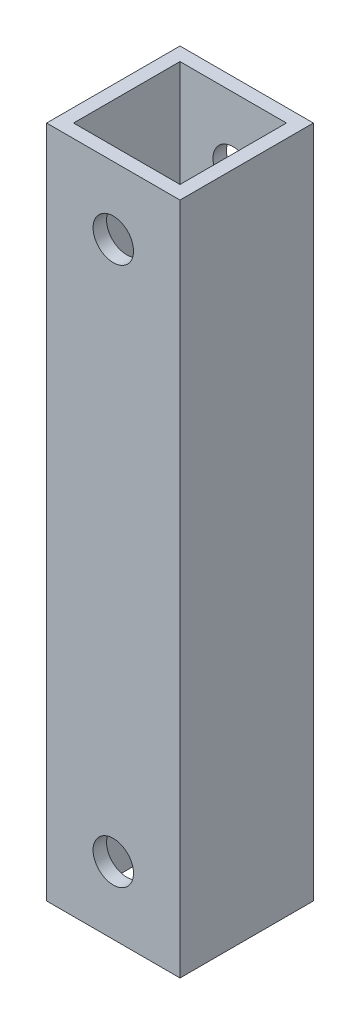
ISO-10303-21;
HEADER;
FILE_DESCRIPTION(('STEP AP214'),'2;1');
FILE_NAME('part.step','',(''),(''),'','','');
FILE_SCHEMA(('AUTOMOTIVE_DESIGN { 1 0 10303 214 1 1 1 1 }'));
ENDSEC;
DATA;
#1=APPLICATION_CONTEXT('core data for automotive mechanical design processes');
#2=APPLICATION_PROTOCOL_DEFINITION('international standard','automotive_design',2000,#1);
#3=PRODUCT_CONTEXT('',#1,'mechanical');
#4=PRODUCT('Part','Part','',(#3));
#5=PRODUCT_RELATED_PRODUCT_CATEGORY('part','',(#4));
#6=PRODUCT_DEFINITION_FORMATION('','',#4);
#7=PRODUCT_DEFINITION_CONTEXT('part definition',#1,'design');
#8=PRODUCT_DEFINITION('design','',#6,#7);
#9=PRODUCT_DEFINITION_SHAPE('','',#8);
#10=(LENGTH_UNIT() NAMED_UNIT(*) SI_UNIT(.MILLI.,.METRE.));
#11=(NAMED_UNIT(*) PLANE_ANGLE_UNIT() SI_UNIT($,.RADIAN.));
#12=(NAMED_UNIT(*) SI_UNIT($,.STERADIAN.) SOLID_ANGLE_UNIT());
#13=UNCERTAINTY_MEASURE_WITH_UNIT(LENGTH_MEASURE(1.E-05),#10,'distance_accuracy_value','');
#14=(GEOMETRIC_REPRESENTATION_CONTEXT(3) GLOBAL_UNCERTAINTY_ASSIGNED_CONTEXT((#13)) GLOBAL_UNIT_ASSIGNED_CONTEXT((#10,
#11,#12)) REPRESENTATION_CONTEXT('',''));
#15=CARTESIAN_POINT('',(0.,0.,0.));
#16=DIRECTION('',(0.,0.,1.));
#17=DIRECTION('',(1.,0.,0.));
#18=AXIS2_PLACEMENT_3D('',#15,#16,#17);
#19=CARTESIAN_POINT('',(0.,50.,0.));
#20=DIRECTION('',(0.,1.,0.));
#21=DIRECTION('',(0.,0.,1.));
#22=AXIS2_PLACEMENT_3D('',#19,#20,#21);
#23=PLANE('',#22);
#24=DIRECTION('',(0.,0.,1.));
#25=VECTOR('',#24,1.);
#26=CARTESIAN_POINT('',(-4.95,50.,4.95));
#27=LINE('',#26,#25);
#28=CARTESIAN_POINT('',(-4.95,50.,-4.95));
#29=VERTEX_POINT('',#28);
#30=CARTESIAN_POINT('',(-4.95,50.,4.95));
#31=VERTEX_POINT('',#30);
#32=EDGE_CURVE('E140',#29,#31,#27,.T.);
#33=ORIENTED_EDGE('',*,*,#32,.T.);
#34=DIRECTION('',(1.,0.,0.));
#35=VECTOR('',#34,1.);
#36=CARTESIAN_POINT('',(4.95,50.,4.95));
#37=LINE('',#36,#35);
#38=CARTESIAN_POINT('',(4.95,50.,4.95));
#39=VERTEX_POINT('',#38);
#40=EDGE_CURVE('E143',#31,#39,#37,.T.);
#41=ORIENTED_EDGE('',*,*,#40,.T.);
#42=DIRECTION('',(0.,0.,-1.));
#43=VECTOR('',#42,1.);
#44=CARTESIAN_POINT('',(4.95,50.,4.95));
#45=LINE('',#44,#43);
#46=CARTESIAN_POINT('',(4.95,50.,-4.95));
#47=VERTEX_POINT('',#46);
#48=EDGE_CURVE('E146',#39,#47,#45,.T.);
#49=ORIENTED_EDGE('',*,*,#48,.T.);
#50=DIRECTION('',(-1.,0.,0.));
#51=VECTOR('',#50,1.);
#52=CARTESIAN_POINT('',(4.95,50.,-4.95));
#53=LINE('',#52,#51);
#54=EDGE_CURVE('E148',#47,#29,#53,.T.);
#55=ORIENTED_EDGE('',*,*,#54,.T.);
#56=EDGE_LOOP('',(#33,#41,#49,#55));
#57=FACE_BOUND('',#56,.T.);
#58=DIRECTION('',(1.,0.,0.));
#59=VECTOR('',#58,1.);
#60=CARTESIAN_POINT('',(3.95,50.,3.95));
#61=LINE('',#60,#59);
#62=CARTESIAN_POINT('',(-3.95,50.,3.95));
#63=VERTEX_POINT('',#62);
#64=CARTESIAN_POINT('',(3.95,50.,3.95));
#65=VERTEX_POINT('',#64);
#66=EDGE_CURVE('E110',#63,#65,#61,.T.);
#67=ORIENTED_EDGE('',*,*,#66,.F.);
#68=DIRECTION('',(0.,0.,1.));
#69=VECTOR('',#68,1.);
#70=CARTESIAN_POINT('',(-3.95,50.,-3.95));
#71=LINE('',#70,#69);
#72=CARTESIAN_POINT('',(-3.95,50.,-3.95));
#73=VERTEX_POINT('',#72);
#74=EDGE_CURVE('E102',#73,#63,#71,.T.);
#75=ORIENTED_EDGE('',*,*,#74,.F.);
#76=DIRECTION('',(-1.,0.,0.));
#77=VECTOR('',#76,1.);
#78=CARTESIAN_POINT('',(3.95,50.,-3.95));
#79=LINE('',#78,#77);
#80=CARTESIAN_POINT('',(3.95,50.,-3.95));
#81=VERTEX_POINT('',#80);
#82=EDGE_CURVE('E124',#81,#73,#79,.T.);
#83=ORIENTED_EDGE('',*,*,#82,.F.);
#84=DIRECTION('',(0.,0.,-1.));
#85=VECTOR('',#84,1.);
#86=CARTESIAN_POINT('',(3.95,50.,-3.95));
#87=LINE('',#86,#85);
#88=EDGE_CURVE('E122',#65,#81,#87,.T.);
#89=ORIENTED_EDGE('',*,*,#88,.F.);
#90=EDGE_LOOP('',(#67,#75,#83,#89));
#91=FACE_BOUND('',#90,.T.);
#92=ADVANCED_FACE('F35',(#57,#91),#23,.T.);
#93=CARTESIAN_POINT('',(0.,0.,0.));
#94=DIRECTION('',(0.,1.,0.));
#95=DIRECTION('',(0.,0.,1.));
#96=AXIS2_PLACEMENT_3D('',#93,#94,#95);
#97=PLANE('',#96);
#98=DIRECTION('',(0.,0.,1.));
#99=VECTOR('',#98,1.);
#100=CARTESIAN_POINT('',(-4.95,0.,4.95));
#101=LINE('',#100,#99);
#102=CARTESIAN_POINT('',(-4.95,0.,-4.95));
#103=VERTEX_POINT('',#102);
#104=CARTESIAN_POINT('',(-4.95,0.,4.95));
#105=VERTEX_POINT('',#104);
#106=EDGE_CURVE('E118',#103,#105,#101,.T.);
#107=ORIENTED_EDGE('',*,*,#106,.F.);
#108=DIRECTION('',(-1.,0.,0.));
#109=VECTOR('',#108,1.);
#110=CARTESIAN_POINT('',(4.95,0.,-4.95));
#111=LINE('',#110,#109);
#112=CARTESIAN_POINT('',(4.95,0.,-4.95));
#113=VERTEX_POINT('',#112);
#114=EDGE_CURVE('E144',#113,#103,#111,.T.);
#115=ORIENTED_EDGE('',*,*,#114,.F.);
#116=DIRECTION('',(0.,0.,-1.));
#117=VECTOR('',#116,1.);
#118=CARTESIAN_POINT('',(4.95,0.,4.95));
#119=LINE('',#118,#117);
#120=CARTESIAN_POINT('',(4.95,0.,4.95));
#121=VERTEX_POINT('',#120);
#122=EDGE_CURVE('E155',#121,#113,#119,.T.);
#123=ORIENTED_EDGE('',*,*,#122,.F.);
#124=DIRECTION('',(1.,0.,0.));
#125=VECTOR('',#124,1.);
#126=CARTESIAN_POINT('',(4.95,0.,4.95));
#127=LINE('',#126,#125);
#128=EDGE_CURVE('E153',#105,#121,#127,.T.);
#129=ORIENTED_EDGE('',*,*,#128,.F.);
#130=EDGE_LOOP('',(#107,#115,#123,#129));
#131=FACE_BOUND('',#130,.T.);
#132=DIRECTION('',(0.,0.,1.));
#133=VECTOR('',#132,1.);
#134=CARTESIAN_POINT('',(-3.95,0.,-3.95));
#135=LINE('',#134,#133);
#136=CARTESIAN_POINT('',(-3.95,0.,-3.95));
#137=VERTEX_POINT('',#136);
#138=CARTESIAN_POINT('',(-3.95,0.,3.95));
#139=VERTEX_POINT('',#138);
#140=EDGE_CURVE('E60',#137,#139,#135,.T.);
#141=ORIENTED_EDGE('',*,*,#140,.T.);
#142=DIRECTION('',(1.,0.,0.));
#143=VECTOR('',#142,1.);
#144=CARTESIAN_POINT('',(3.95,0.,3.95));
#145=LINE('',#144,#143);
#146=CARTESIAN_POINT('',(3.95,0.,3.95));
#147=VERTEX_POINT('',#146);
#148=EDGE_CURVE('E117',#139,#147,#145,.T.);
#149=ORIENTED_EDGE('',*,*,#148,.T.);
#150=DIRECTION('',(0.,0.,-1.));
#151=VECTOR('',#150,1.);
#152=CARTESIAN_POINT('',(3.95,0.,-3.95));
#153=LINE('',#152,#151);
#154=CARTESIAN_POINT('',(3.95,0.,-3.95));
#155=VERTEX_POINT('',#154);
#156=EDGE_CURVE('E132',#147,#155,#153,.T.);
#157=ORIENTED_EDGE('',*,*,#156,.T.);
#158=DIRECTION('',(-1.,0.,0.));
#159=VECTOR('',#158,1.);
#160=CARTESIAN_POINT('',(3.95,0.,-3.95));
#161=LINE('',#160,#159);
#162=EDGE_CURVE('E111',#155,#137,#161,.T.);
#163=ORIENTED_EDGE('',*,*,#162,.T.);
#164=EDGE_LOOP('',(#141,#149,#157,#163));
#165=FACE_BOUND('',#164,.T.);
#166=ADVANCED_FACE('F202',(#131,#165),#97,.F.);
#167=CARTESIAN_POINT('',(-4.95,50.,4.95));
#168=DIRECTION('',(1.,0.,0.));
#169=DIRECTION('',(0.,0.,-1.));
#170=AXIS2_PLACEMENT_3D('',#167,#168,#169);
#171=PLANE('',#170);
#172=ORIENTED_EDGE('',*,*,#106,.T.);
#173=DIRECTION('',(0.,-1.,0.));
#174=VECTOR('',#173,1.);
#175=CARTESIAN_POINT('',(-4.95,50.,4.95));
#176=LINE('',#175,#174);
#177=EDGE_CURVE('E11',#31,#105,#176,.T.);
#178=ORIENTED_EDGE('',*,*,#177,.F.);
#179=ORIENTED_EDGE('',*,*,#32,.F.);
#180=DIRECTION('',(0.,-1.,0.));
#181=VECTOR('',#180,1.);
#182=CARTESIAN_POINT('',(-4.95,50.,-4.95));
#183=LINE('',#182,#181);
#184=EDGE_CURVE('E150',#29,#103,#183,.T.);
#185=ORIENTED_EDGE('',*,*,#184,.T.);
#186=EDGE_LOOP('',(#172,#178,#179,#185));
#187=FACE_BOUND('',#186,.T.);
#188=ADVANCED_FACE('F37',(#187),#171,.F.);
#189=CARTESIAN_POINT('',(4.95,50.,4.95));
#190=DIRECTION('',(0.,0.,-1.));
#191=DIRECTION('',(-1.,0.,0.));
#192=AXIS2_PLACEMENT_3D('',#189,#190,#191);
#193=PLANE('',#192);
#194=CARTESIAN_POINT('',(0.,5.,4.95));
#195=DIRECTION('',(0.,0.,-1.));
#196=DIRECTION('',(-1.,0.,0.));
#197=AXIS2_PLACEMENT_3D('',#194,#195,#196);
#198=CIRCLE('',#197,1.5);
#199=CARTESIAN_POINT('',(-1.50000000000001,5.,4.95));
#200=VERTEX_POINT('',#199);
#201=EDGE_CURVE('E184',#200,#200,#198,.T.);
#202=ORIENTED_EDGE('',*,*,#201,.T.);
#203=EDGE_LOOP('',(#202));
#204=FACE_BOUND('',#203,.T.);
#205=CARTESIAN_POINT('',(0.,45.,4.95));
#206=DIRECTION('',(0.,0.,-1.));
#207=DIRECTION('',(-1.,0.,0.));
#208=AXIS2_PLACEMENT_3D('',#205,#206,#207);
#209=CIRCLE('',#208,1.5);
#210=CARTESIAN_POINT('',(-1.5,45.,4.95));
#211=VERTEX_POINT('',#210);
#212=EDGE_CURVE('E166',#211,#211,#209,.T.);
#213=ORIENTED_EDGE('',*,*,#212,.T.);
#214=EDGE_LOOP('',(#213));
#215=FACE_BOUND('',#214,.T.);
#216=ORIENTED_EDGE('',*,*,#128,.T.);
#217=DIRECTION('',(0.,-1.,0.));
#218=VECTOR('',#217,1.);
#219=CARTESIAN_POINT('',(4.95,50.,4.95));
#220=LINE('',#219,#218);
#221=EDGE_CURVE('E44',#39,#121,#220,.T.);
#222=ORIENTED_EDGE('',*,*,#221,.F.);
#223=ORIENTED_EDGE('',*,*,#40,.F.);
#224=ORIENTED_EDGE('',*,*,#177,.T.);
#225=EDGE_LOOP('',(#216,#222,#223,#224));
#226=FACE_BOUND('',#225,.T.);
#227=ADVANCED_FACE('F227',(#204,#215,#226),#193,.F.);
#228=CARTESIAN_POINT('',(4.95,50.,4.95));
#229=DIRECTION('',(-1.,0.,0.));
#230=DIRECTION('',(0.,0.,1.));
#231=AXIS2_PLACEMENT_3D('',#228,#229,#230);
#232=PLANE('',#231);
#233=ORIENTED_EDGE('',*,*,#122,.T.);
#234=DIRECTION('',(0.,-1.,0.));
#235=VECTOR('',#234,1.);
#236=CARTESIAN_POINT('',(4.95,50.,-4.95));
#237=LINE('',#236,#235);
#238=EDGE_CURVE('E160',#47,#113,#237,.T.);
#239=ORIENTED_EDGE('',*,*,#238,.F.);
#240=ORIENTED_EDGE('',*,*,#48,.F.);
#241=ORIENTED_EDGE('',*,*,#221,.T.);
#242=EDGE_LOOP('',(#233,#239,#240,#241));
#243=FACE_BOUND('',#242,.T.);
#244=ADVANCED_FACE('F224',(#243),#232,.F.);
#245=CARTESIAN_POINT('',(4.95,50.,-4.95));
#246=DIRECTION('',(0.,0.,1.));
#247=DIRECTION('',(1.,0.,0.));
#248=AXIS2_PLACEMENT_3D('',#245,#246,#247);
#249=PLANE('',#248);
#250=CARTESIAN_POINT('',(0.,5.,-4.95));
#251=DIRECTION('',(0.,0.,-1.));
#252=DIRECTION('',(-1.,0.,0.));
#253=AXIS2_PLACEMENT_3D('',#250,#251,#252);
#254=CIRCLE('',#253,1.5);
#255=CARTESIAN_POINT('',(-1.50000000000001,5.,-4.95));
#256=VERTEX_POINT('',#255);
#257=EDGE_CURVE('E181',#256,#256,#254,.T.);
#258=ORIENTED_EDGE('',*,*,#257,.F.);
#259=EDGE_LOOP('',(#258));
#260=FACE_BOUND('',#259,.T.);
#261=CARTESIAN_POINT('',(0.,45.,-4.95));
#262=DIRECTION('',(0.,0.,-1.));
#263=DIRECTION('',(-1.,0.,0.));
#264=AXIS2_PLACEMENT_3D('',#261,#262,#263);
#265=CIRCLE('',#264,1.5);
#266=CARTESIAN_POINT('',(-1.5,45.,-4.95));
#267=VERTEX_POINT('',#266);
#268=EDGE_CURVE('E171',#267,#267,#265,.T.);
#269=ORIENTED_EDGE('',*,*,#268,.F.);
#270=EDGE_LOOP('',(#269));
#271=FACE_BOUND('',#270,.T.);
#272=ORIENTED_EDGE('',*,*,#114,.T.);
#273=ORIENTED_EDGE('',*,*,#184,.F.);
#274=ORIENTED_EDGE('',*,*,#54,.F.);
#275=ORIENTED_EDGE('',*,*,#238,.T.);
#276=EDGE_LOOP('',(#272,#273,#274,#275));
#277=FACE_BOUND('',#276,.T.);
#278=ADVANCED_FACE('F221',(#260,#271,#277),#249,.F.);
#279=CARTESIAN_POINT('',(-3.95,50.,-3.95));
#280=DIRECTION('',(1.,0.,0.));
#281=DIRECTION('',(0.,0.,-1.));
#282=AXIS2_PLACEMENT_3D('',#279,#280,#281);
#283=PLANE('',#282);
#284=ORIENTED_EDGE('',*,*,#140,.F.);
#285=DIRECTION('',(0.,-1.,0.));
#286=VECTOR('',#285,1.);
#287=CARTESIAN_POINT('',(-3.95,50.,-3.95));
#288=LINE('',#287,#286);
#289=EDGE_CURVE('E106',#73,#137,#288,.T.);
#290=ORIENTED_EDGE('',*,*,#289,.F.);
#291=ORIENTED_EDGE('',*,*,#74,.T.);
#292=DIRECTION('',(0.,-1.,0.));
#293=VECTOR('',#292,1.);
#294=CARTESIAN_POINT('',(-3.95,50.,3.95));
#295=LINE('',#294,#293);
#296=EDGE_CURVE('E105',#63,#139,#295,.T.);
#297=ORIENTED_EDGE('',*,*,#296,.T.);
#298=EDGE_LOOP('',(#284,#290,#291,#297));
#299=FACE_BOUND('',#298,.T.);
#300=ADVANCED_FACE('F104',(#299),#283,.T.);
#301=CARTESIAN_POINT('',(3.95,50.,3.95));
#302=DIRECTION('',(0.,0.,-1.));
#303=DIRECTION('',(-1.,0.,0.));
#304=AXIS2_PLACEMENT_3D('',#301,#302,#303);
#305=PLANE('',#304);
#306=CARTESIAN_POINT('',(0.,5.,3.95));
#307=DIRECTION('',(0.,0.,-1.));
#308=DIRECTION('',(-1.,0.,0.));
#309=AXIS2_PLACEMENT_3D('',#306,#307,#308);
#310=CIRCLE('',#309,1.5);
#311=CARTESIAN_POINT('',(-1.50000000000001,5.,3.95));
#312=VERTEX_POINT('',#311);
#313=EDGE_CURVE('E176',#312,#312,#310,.T.);
#314=ORIENTED_EDGE('',*,*,#313,.F.);
#315=EDGE_LOOP('',(#314));
#316=FACE_BOUND('',#315,.T.);
#317=CARTESIAN_POINT('',(0.,45.,3.95));
#318=DIRECTION('',(0.,0.,-1.));
#319=DIRECTION('',(-1.,0.,0.));
#320=AXIS2_PLACEMENT_3D('',#317,#318,#319);
#321=CIRCLE('',#320,1.5);
#322=CARTESIAN_POINT('',(-1.5,45.,3.95));
#323=VERTEX_POINT('',#322);
#324=EDGE_CURVE('E130',#323,#323,#321,.T.);
#325=ORIENTED_EDGE('',*,*,#324,.F.);
#326=EDGE_LOOP('',(#325));
#327=FACE_BOUND('',#326,.T.);
#328=ORIENTED_EDGE('',*,*,#148,.F.);
#329=ORIENTED_EDGE('',*,*,#296,.F.);
#330=ORIENTED_EDGE('',*,*,#66,.T.);
#331=DIRECTION('',(0.,-1.,0.));
#332=VECTOR('',#331,1.);
#333=CARTESIAN_POINT('',(3.95,50.,3.95));
#334=LINE('',#333,#332);
#335=EDGE_CURVE('E119',#65,#147,#334,.T.);
#336=ORIENTED_EDGE('',*,*,#335,.T.);
#337=EDGE_LOOP('',(#328,#329,#330,#336));
#338=FACE_BOUND('',#337,.T.);
#339=ADVANCED_FACE('F114',(#316,#327,#338),#305,.T.);
#340=CARTESIAN_POINT('',(3.95,50.,-3.95));
#341=DIRECTION('',(-1.,0.,0.));
#342=DIRECTION('',(0.,0.,1.));
#343=AXIS2_PLACEMENT_3D('',#340,#341,#342);
#344=PLANE('',#343);
#345=ORIENTED_EDGE('',*,*,#156,.F.);
#346=ORIENTED_EDGE('',*,*,#335,.F.);
#347=ORIENTED_EDGE('',*,*,#88,.T.);
#348=DIRECTION('',(0.,-1.,0.));
#349=VECTOR('',#348,1.);
#350=CARTESIAN_POINT('',(3.95,50.,-3.95));
#351=LINE('',#350,#349);
#352=EDGE_CURVE('E52',#81,#155,#351,.T.);
#353=ORIENTED_EDGE('',*,*,#352,.T.);
#354=EDGE_LOOP('',(#345,#346,#347,#353));
#355=FACE_BOUND('',#354,.T.);
#356=ADVANCED_FACE('F198',(#355),#344,.T.);
#357=CARTESIAN_POINT('',(3.95,50.,-3.95));
#358=DIRECTION('',(0.,0.,1.));
#359=DIRECTION('',(1.,0.,0.));
#360=AXIS2_PLACEMENT_3D('',#357,#358,#359);
#361=PLANE('',#360);
#362=CARTESIAN_POINT('',(0.,5.,-3.95));
#363=DIRECTION('',(0.,0.,1.));
#364=DIRECTION('',(1.,0.,0.));
#365=AXIS2_PLACEMENT_3D('',#362,#363,#364);
#366=CIRCLE('',#365,1.5);
#367=CARTESIAN_POINT('',(1.5,5.,-3.95));
#368=VERTEX_POINT('',#367);
#369=EDGE_CURVE('E39',#368,#368,#366,.T.);
#370=ORIENTED_EDGE('',*,*,#369,.F.);
#371=EDGE_LOOP('',(#370));
#372=FACE_BOUND('',#371,.T.);
#373=CARTESIAN_POINT('',(0.,45.,-3.95));
#374=DIRECTION('',(0.,0.,1.));
#375=DIRECTION('',(1.,0.,0.));
#376=AXIS2_PLACEMENT_3D('',#373,#374,#375);
#377=CIRCLE('',#376,1.5);
#378=CARTESIAN_POINT('',(1.5,45.,-3.95));
#379=VERTEX_POINT('',#378);
#380=EDGE_CURVE('E164',#379,#379,#377,.T.);
#381=ORIENTED_EDGE('',*,*,#380,.F.);
#382=EDGE_LOOP('',(#381));
#383=FACE_BOUND('',#382,.T.);
#384=ORIENTED_EDGE('',*,*,#162,.F.);
#385=ORIENTED_EDGE('',*,*,#352,.F.);
#386=ORIENTED_EDGE('',*,*,#82,.T.);
#387=ORIENTED_EDGE('',*,*,#289,.T.);
#388=EDGE_LOOP('',(#384,#385,#386,#387));
#389=FACE_BOUND('',#388,.T.);
#390=ADVANCED_FACE('F194',(#372,#383,#389),#361,.T.);
#391=CARTESIAN_POINT('',(0.,45.,4.95));
#392=DIRECTION('',(0.,0.,-1.));
#393=DIRECTION('',(-1.,0.,0.));
#394=AXIS2_PLACEMENT_3D('',#391,#392,#393);
#395=CYLINDRICAL_SURFACE('',#394,1.5);
#396=ORIENTED_EDGE('',*,*,#380,.T.);
#397=EDGE_LOOP('',(#396));
#398=FACE_BOUND('',#397,.T.);
#399=ORIENTED_EDGE('',*,*,#268,.T.);
#400=EDGE_LOOP('',(#399));
#401=FACE_BOUND('',#400,.T.);
#402=ADVANCED_FACE('F197',(#398,#401),#395,.F.);
#403=ORIENTED_EDGE('',*,*,#324,.T.);
#404=EDGE_LOOP('',(#403));
#405=FACE_BOUND('',#404,.T.);
#406=ORIENTED_EDGE('',*,*,#212,.F.);
#407=EDGE_LOOP('',(#406));
#408=FACE_BOUND('',#407,.T.);
#409=ADVANCED_FACE('F302',(#405,#408),#395,.F.);
#410=CARTESIAN_POINT('',(0.,5.,4.95));
#411=DIRECTION('',(0.,0.,-1.));
#412=DIRECTION('',(-1.,0.,0.));
#413=AXIS2_PLACEMENT_3D('',#410,#411,#412);
#414=CYLINDRICAL_SURFACE('',#413,1.5);
#415=ORIENTED_EDGE('',*,*,#369,.T.);
#416=EDGE_LOOP('',(#415));
#417=FACE_BOUND('',#416,.T.);
#418=ORIENTED_EDGE('',*,*,#257,.T.);
#419=EDGE_LOOP('',(#418));
#420=FACE_BOUND('',#419,.T.);
#421=ADVANCED_FACE('F191',(#417,#420),#414,.F.);
#422=ORIENTED_EDGE('',*,*,#313,.T.);
#423=EDGE_LOOP('',(#422));
#424=FACE_BOUND('',#423,.T.);
#425=ORIENTED_EDGE('',*,*,#201,.F.);
#426=EDGE_LOOP('',(#425));
#427=FACE_BOUND('',#426,.T.);
#428=ADVANCED_FACE('F317',(#424,#427),#414,.F.);
#429=CLOSED_SHELL('',(#92,#166,#188,#227,#244,#278,#300,#339,#356,#390,#402,#409,#421,#428));
#430=MANIFOLD_SOLID_BREP('B2',#429);
#431=ADVANCED_BREP_SHAPE_REPRESENTATION('',(#18,#430),#14);
#432=SHAPE_DEFINITION_REPRESENTATION(#9,#431);
ENDSEC;
END-ISO-10303-21;
